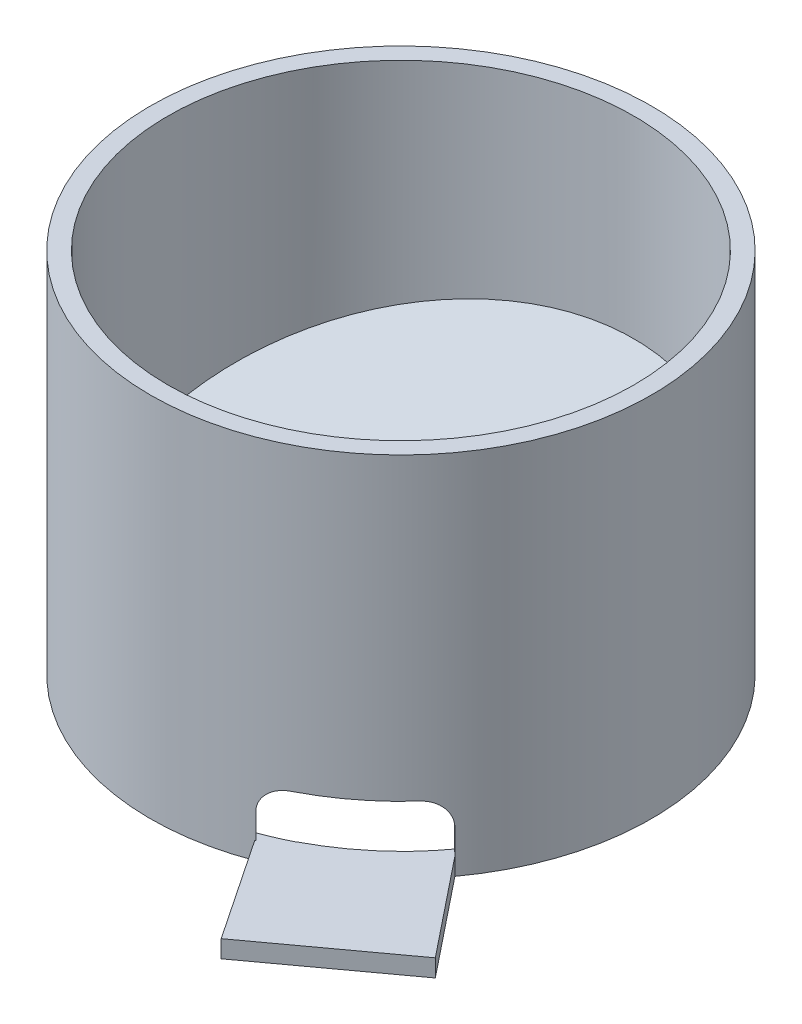
ISO-10303-21;
HEADER;
FILE_DESCRIPTION(('STEP AP214'),'2;1');
FILE_NAME('part.step','',(''),(''),'','','');
FILE_SCHEMA(('AUTOMOTIVE_DESIGN { 1 0 10303 214 1 1 1 1 }'));
ENDSEC;
DATA;
#1=APPLICATION_CONTEXT('core data for automotive mechanical design processes');
#2=APPLICATION_PROTOCOL_DEFINITION('international standard','automotive_design',2000,#1);
#3=PRODUCT_CONTEXT('',#1,'mechanical');
#4=PRODUCT('Part','Part','',(#3));
#5=PRODUCT_RELATED_PRODUCT_CATEGORY('part','',(#4));
#6=PRODUCT_DEFINITION_FORMATION('','',#4);
#7=PRODUCT_DEFINITION_CONTEXT('part definition',#1,'design');
#8=PRODUCT_DEFINITION('design','',#6,#7);
#9=PRODUCT_DEFINITION_SHAPE('','',#8);
#10=(LENGTH_UNIT() NAMED_UNIT(*) SI_UNIT(.MILLI.,.METRE.));
#11=(NAMED_UNIT(*) PLANE_ANGLE_UNIT() SI_UNIT($,.RADIAN.));
#12=(NAMED_UNIT(*) SI_UNIT($,.STERADIAN.) SOLID_ANGLE_UNIT());
#13=UNCERTAINTY_MEASURE_WITH_UNIT(LENGTH_MEASURE(1.E-05),#10,'distance_accuracy_value','');
#14=(GEOMETRIC_REPRESENTATION_CONTEXT(3) GLOBAL_UNCERTAINTY_ASSIGNED_CONTEXT((#13)) GLOBAL_UNIT_ASSIGNED_CONTEXT((#10,
#11,#12)) REPRESENTATION_CONTEXT('',''));
#15=CARTESIAN_POINT('',(0.,0.,0.));
#16=DIRECTION('',(0.,0.,1.));
#17=DIRECTION('',(1.,0.,0.));
#18=AXIS2_PLACEMENT_3D('',#15,#16,#17);
#19=CARTESIAN_POINT('',(14.9059247499879,0.,39.87722304956));
#20=DIRECTION('',(-0.590200374501547,0.,-0.807256785625388));
#21=DIRECTION('',(-0.807256785625388,0.,0.590200374501547));
#22=AXIS2_PLACEMENT_3D('',#19,#20,#21);
#23=PLANE('',#22);
#24=DIRECTION('',(0.,-1.,0.));
#25=VECTOR('',#24,1.);
#26=CARTESIAN_POINT('',(29.3445279209477,4.,29.3208930805553));
#27=LINE('',#26,#25);
#28=CARTESIAN_POINT('',(29.3445279209476,3.,29.3208930805553));
#29=VERTEX_POINT('',#28);
#30=CARTESIAN_POINT('',(29.3445279209476,0.,29.3208930805554));
#31=VERTEX_POINT('',#30);
#32=EDGE_CURVE('E11',#29,#31,#27,.T.);
#33=ORIENTED_EDGE('',*,*,#32,.F.);
#34=DIRECTION('',(-0.807256785625388,0.,0.590200374501547));
#35=VECTOR('',#34,1.);
#36=CARTESIAN_POINT('',(14.9059247499879,3.,39.87722304956));
#37=LINE('',#36,#35);
#38=CARTESIAN_POINT('',(29.4344119465568,3.,29.2551772061014));
#39=VERTEX_POINT('',#38);
#40=EDGE_CURVE('E182',#39,#29,#37,.T.);
#41=ORIENTED_EDGE('',*,*,#40,.F.);
#42=DIRECTION('',(0.,-1.,0.));
#43=VECTOR('',#42,1.);
#44=CARTESIAN_POINT('',(29.4344119465568,3.,29.2551772061014));
#45=LINE('',#44,#43);
#46=CARTESIAN_POINT('',(29.4344119465567,0.,29.2551772061015));
#47=VERTEX_POINT('',#46);
#48=EDGE_CURVE('E163',#47,#39,#45,.F.);
#49=ORIENTED_EDGE('',*,*,#48,.F.);
#50=DIRECTION('',(-0.807256785625388,0.,0.590200374501547));
#51=VECTOR('',#50,1.);
#52=CARTESIAN_POINT('',(14.9059247499879,0.,39.87722304956));
#53=LINE('',#52,#51);
#54=EDGE_CURVE('E158',#47,#31,#53,.T.);
#55=ORIENTED_EDGE('',*,*,#54,.T.);
#56=EDGE_LOOP('',(#33,#41,#49,#55));
#57=FACE_BOUND('',#56,.T.);
#58=ADVANCED_FACE('F32',(#57),#23,.T.);
#59=CARTESIAN_POINT('',(0.,63.,0.));
#60=DIRECTION('',(0.,-1.,0.));
#61=DIRECTION('',(0.,0.,-1.));
#62=AXIS2_PLACEMENT_3D('',#59,#60,#61);
#63=CYLINDRICAL_SURFACE('',#62,40.);
#64=DIRECTION('',(0.,-1.,0.));
#65=VECTOR('',#64,1.);
#66=CARTESIAN_POINT('',(12.8586087223702,63.,37.8768554888732));
#67=LINE('',#66,#65);
#68=CARTESIAN_POINT('',(12.8586087223702,7.25,37.8768554888732));
#69=VERTEX_POINT('',#68);
#70=CARTESIAN_POINT('',(12.8586087223702,3.,37.8768554888732));
#71=VERTEX_POINT('',#70);
#72=EDGE_CURVE('E225',#69,#71,#67,.T.);
#73=ORIENTED_EDGE('',*,*,#72,.T.);
#74=CARTESIAN_POINT('',(0.,3.,0.));
#75=DIRECTION('',(0.,-1.,0.));
#76=DIRECTION('',(0.,0.,-1.));
#77=AXIS2_PLACEMENT_3D('',#74,#75,#76);
#78=CIRCLE('',#77,40.);
#79=CARTESIAN_POINT('',(32.4982527265658,3.,23.3208826959928));
#80=VERTEX_POINT('',#79);
#81=EDGE_CURVE('E283',#71,#80,#78,.T.);
#82=ORIENTED_EDGE('',*,*,#81,.T.);
#83=DIRECTION('',(0.,-1.,0.));
#84=VECTOR('',#83,1.);
#85=CARTESIAN_POINT('',(32.4982527265658,63.,23.3208826959929));
#86=LINE('',#85,#84);
#87=CARTESIAN_POINT('',(32.4982527265658,7.25,23.3208826959928));
#88=VERTEX_POINT('',#87);
#89=EDGE_CURVE('E204',#80,#88,#86,.F.);
#90=ORIENTED_EDGE('',*,*,#89,.T.);
#91=CARTESIAN_POINT('',(32.4982527265658,7.25,23.3208826959928));
#92=CARTESIAN_POINT('',(32.4982577471647,7.36884260870351,23.3208688099019));
#93=CARTESIAN_POINT('',(32.4953171145322,7.48768257288682,23.3249733341994));
#94=CARTESIAN_POINT('',(32.4835811137329,7.72450154242642,23.3413184090219));
#95=CARTESIAN_POINT('',(32.4747862216721,7.84248061700704,23.3535582979268));
#96=CARTESIAN_POINT('',(32.4513916496947,8.07660775951056,23.3860547414548));
#97=CARTESIAN_POINT('',(32.4367986211488,8.19275776748268,23.4063021101219));
#98=CARTESIAN_POINT('',(32.4018788383984,8.42254026573257,23.4546187654033));
#99=CARTESIAN_POINT('',(32.3815521142613,8.53617276920867,23.4826880109999));
#100=CARTESIAN_POINT('',(32.3352575672257,8.7601357282766,23.5463938921091));
#101=CARTESIAN_POINT('',(32.309289000433,8.87046574624086,23.5820315255228));
#102=CARTESIAN_POINT('',(32.2518264290729,9.08707587589191,23.6605591580926));
#103=CARTESIAN_POINT('',(32.2203303837283,9.19335447406905,23.7034518356405));
#104=CARTESIAN_POINT('',(32.1519786208148,9.40104611337569,23.7960832507992));
#105=CARTESIAN_POINT('',(32.1151251548937,9.5024611748838,23.8458191118493));
#106=CARTESIAN_POINT('',(32.0362293740246,9.69978679836063,23.9517091936018));
#107=CARTESIAN_POINT('',(31.9941851386052,9.79569530368114,24.0078657892645));
#108=CARTESIAN_POINT('',(31.8600485007693,10.0751800826647,24.1859347306249));
#109=CARTESIAN_POINT('',(31.7602894437638,10.249486828137,24.316985061015));
#110=CARTESIAN_POINT('',(31.5425743837892,10.5681864643716,24.5987325686261));
#111=CARTESIAN_POINT('',(31.424614522327,10.7125729969334,24.7494339107263));
#112=CARTESIAN_POINT('',(31.1721627195108,10.9683464919181,25.0666626846308));
#113=CARTESIAN_POINT('',(31.0375684953067,11.0795133028842,25.2332864414905));
#114=CARTESIAN_POINT('',(30.7556191562859,11.2642958314108,25.5761807882963));
#115=CARTESIAN_POINT('',(30.6082719990185,11.3379347707236,25.7524453376837));
#116=CARTESIAN_POINT('',(30.3550540482441,11.4276844268834,26.049860271274));
#117=CARTESIAN_POINT('',(30.2516366260293,11.4547750196318,26.1698993862704));
#118=CARTESIAN_POINT('',(30.0421594374652,11.49093367365,26.4101173085203));
#119=CARTESIAN_POINT('',(29.9361031242194,11.5000241500839,26.5302957553266));
#120=CARTESIAN_POINT('',(29.8292553554512,11.5,26.6498691355002));
#121=B_SPLINE_CURVE_WITH_KNOTS('',3,(#91,#92,#93,#94,#95,#96,#97,#98,#99,#100,#101,#102,#103,
#104,#105,#106,#107,#108,#109,#110,#111,#112,#113,#114,#115,#116,#117,#118,#119,#120),
.UNSPECIFIED.,.F.,.F.,(4,2,2,2,2,2,2,2,2,2,2,2,2,2,4),(0.,0.35641672770918,0.712804472865604,
1.06878456042684,1.42476278127904,1.78078796746734,2.13694487781616,2.49295253093555,
2.84909229607266,3.56485836030117,4.28077637290381,5.00133869533878,5.72145460026396,
6.20271795961621,6.6833816340378),.UNSPECIFIED.);
#122=CARTESIAN_POINT('',(29.8292553554512,11.5,26.6498691355002));
#123=VERTEX_POINT('',#122);
#124=EDGE_CURVE('E194',#88,#123,#121,.T.);
#125=ORIENTED_EDGE('',*,*,#124,.T.);
#126=CARTESIAN_POINT('',(0.,11.5,0.));
#127=DIRECTION('',(0.,1.,0.));
#128=DIRECTION('',(0.,0.,1.));
#129=AXIS2_PLACEMENT_3D('',#126,#127,#128);
#130=CIRCLE('',#129,40.);
#131=CARTESIAN_POINT('',(17.172839901921,11.5,36.1260788033103));
#132=VERTEX_POINT('',#131);
#133=EDGE_CURVE('E226',#123,#132,#130,.F.);
#134=ORIENTED_EDGE('',*,*,#133,.T.);
#135=CARTESIAN_POINT('',(17.172839901921,11.5,36.1260788033104));
#136=CARTESIAN_POINT('',(17.0483724960303,11.4999968971606,36.1852501738238));
#137=CARTESIAN_POINT('',(16.9236577774394,11.494137630218,36.2437401882979));
#138=CARTESIAN_POINT('',(16.6745387359936,11.4708718112855,36.3590227829476));
#139=CARTESIAN_POINT('',(16.5501343764667,11.4534666954045,36.4158155733113));
#140=CARTESIAN_POINT('',(16.1786976635341,11.3842058810773,36.5831003541278));
#141=CARTESIAN_POINT('',(15.9332887806434,11.3153043052489,36.6905713228706));
#142=CARTESIAN_POINT('',(15.4543457982531,11.133946707841,36.8948647059835));
#143=CARTESIAN_POINT('',(15.2208131550314,11.0214853594118,36.9916858161407));
#144=CARTESIAN_POINT('',(14.8851620498599,10.8221311911214,37.1274381202419));
#145=CARTESIAN_POINT('',(14.7756661093771,10.7505238556028,37.1711294072781));
#146=CARTESIAN_POINT('',(14.5624862851076,10.5974100860349,37.2551617411653));
#147=CARTESIAN_POINT('',(14.458799973016,10.515907833654,37.2955041912079));
#148=CARTESIAN_POINT('',(14.2593978680722,10.344404065874,37.3721937375141));
#149=CARTESIAN_POINT('',(14.163603628389,10.254511998442,37.4085817188786));
#150=CARTESIAN_POINT('',(13.9797156944909,10.0659528401719,37.477689235785));
#151=CARTESIAN_POINT('',(13.8916181869812,9.96729014413051,37.51041059023));
#152=CARTESIAN_POINT('',(13.7241092784845,9.76170106455275,37.5720214203036));
#153=CARTESIAN_POINT('',(13.644699081551,9.65477353901418,37.6009103648814));
#154=CARTESIAN_POINT('',(13.4956514249381,9.43336396192428,37.6546633448806));
#155=CARTESIAN_POINT('',(13.426012603248,9.31888296651168,37.6795279413215));
#156=CARTESIAN_POINT('',(13.3029094054325,9.09303839029065,37.723156095744));
#157=CARTESIAN_POINT('',(13.2485806163436,8.98221054040497,37.7422554650956));
#158=CARTESIAN_POINT('',(13.1497806526658,8.75570327395567,37.7767919489013));
#159=CARTESIAN_POINT('',(13.1053079208895,8.64002462722304,37.7922296419014));
#160=CARTESIAN_POINT('',(13.0269758194965,8.40494200800249,37.819302193559));
#161=CARTESIAN_POINT('',(12.9930962462077,8.28554561056957,37.8309442931501));
#162=CARTESIAN_POINT('',(12.9364136678875,8.04390220044637,37.8503645989604));
#163=CARTESIAN_POINT('',(12.9136039984202,7.92165694943519,37.8581451300315));
#164=CARTESIAN_POINT('',(12.8839162306674,7.7076995338805,37.8682569362919));
#165=CARTESIAN_POINT('',(12.8744293843573,7.61638267353988,37.8714819757316));
#166=CARTESIAN_POINT('',(12.8617751819368,7.43338148418634,37.8757805134898));
#167=CARTESIAN_POINT('',(12.8585996369725,7.34169778620419,37.8768567998032));
#168=CARTESIAN_POINT('',(12.8586087223702,7.25,37.8768554888732));
#169=B_SPLINE_CURVE_WITH_KNOTS('',3,(#135,#136,#137,#138,#139,#140,#141,#142,#143,#144,#145,
#146,#147,#148,#149,#150,#151,#152,#153,#154,#155,#156,#157,#158,#159,#160,#161,#162,#163,#164,
#165,#166,#167,#168),.UNSPECIFIED.,.F.,.F.,(4,2,2,2,2,2,2,2,2,2,2,2,2,2,2,2,4),(0.,
0.413191244283983,0.826331104180502,1.65210961653774,2.47798914383197,2.8913625013443,
3.30456176823157,3.71297231550807,4.12117935724059,4.52944290462306,4.93764948839284,
5.31182585468265,5.68594306153905,6.05934232301087,6.43251650646414,6.70787933064908,
6.98288464031937),.UNSPECIFIED.);
#170=EDGE_CURVE('E215',#132,#69,#169,.T.);
#171=ORIENTED_EDGE('',*,*,#170,.T.);
#172=EDGE_LOOP('',(#73,#82,#90,#125,#134,#171));
#173=FACE_BOUND('',#172,.T.);
#174=CARTESIAN_POINT('',(0.,63.,0.));
#175=DIRECTION('',(0.,1.,0.));
#176=DIRECTION('',(0.,0.,1.));
#177=AXIS2_PLACEMENT_3D('',#174,#175,#176);
#178=CIRCLE('',#177,40.);
#179=CARTESIAN_POINT('',(0.,63.,40.));
#180=VERTEX_POINT('',#179);
#181=EDGE_CURVE('E279',#180,#180,#178,.T.);
#182=ORIENTED_EDGE('',*,*,#181,.T.);
#183=EDGE_LOOP('',(#182));
#184=FACE_BOUND('',#183,.T.);
#185=CARTESIAN_POINT('',(0.,13.,0.));
#186=DIRECTION('',(0.,1.,0.));
#187=DIRECTION('',(0.,0.,1.));
#188=AXIS2_PLACEMENT_3D('',#185,#186,#187);
#189=CIRCLE('',#188,40.);
#190=CARTESIAN_POINT('',(37.0809924354783,13.,15.));
#191=VERTEX_POINT('',#190);
#192=CARTESIAN_POINT('',(32.7261363439071,13.,23.));
#193=VERTEX_POINT('',#192);
#194=EDGE_CURVE('E322',#191,#193,#189,.F.);
#195=ORIENTED_EDGE('',*,*,#194,.F.);
#196=CARTESIAN_POINT('',(0.,17.0192378864669,0.));
#197=DIRECTION('',(0.,0.965925826289068,0.258819045102522));
#198=DIRECTION('',(0.,-0.258819045102522,0.965925826289068));
#199=AXIS2_PLACEMENT_3D('',#196,#197,#198);
#200=ELLIPSE('',#199,41.4110472164033,40.);
#201=CARTESIAN_POINT('',(-37.0809924354783,13.,15.));
#202=VERTEX_POINT('',#201);
#203=EDGE_CURVE('E330',#202,#191,#200,.F.);
#204=ORIENTED_EDGE('',*,*,#203,.F.);
#205=CARTESIAN_POINT('',(0.,13.,0.));
#206=DIRECTION('',(0.,-1.,0.));
#207=DIRECTION('',(0.,0.,-1.));
#208=AXIS2_PLACEMENT_3D('',#205,#206,#207);
#209=CIRCLE('',#208,40.);
#210=CARTESIAN_POINT('',(-32.7261363439071,13.,23.));
#211=VERTEX_POINT('',#210);
#212=EDGE_CURVE('E318',#202,#211,#209,.F.);
#213=ORIENTED_EDGE('',*,*,#212,.T.);
#214=CARTESIAN_POINT('',(0.,19.1628314259158,0.));
#215=DIRECTION('',(0.,-0.965925826289068,-0.258819045102522));
#216=DIRECTION('',(0.,-0.258819045102522,0.965925826289068));
#217=AXIS2_PLACEMENT_3D('',#214,#215,#216);
#218=ELLIPSE('',#217,41.4110472164033,40.);
#219=EDGE_CURVE('E332',#193,#211,#218,.F.);
#220=ORIENTED_EDGE('',*,*,#219,.F.);
#221=EDGE_LOOP('',(#195,#204,#213,#220));
#222=FACE_BOUND('',#221,.T.);
#223=ADVANCED_FACE('F344',(#173,#184,#222),#63,.F.);
#224=CARTESIAN_POINT('',(0.,63.,0.));
#225=DIRECTION('',(0.,1.,0.));
#226=DIRECTION('',(0.,0.,1.));
#227=AXIS2_PLACEMENT_3D('',#224,#225,#226);
#228=PLANE('',#227);
#229=CARTESIAN_POINT('',(0.,63.,0.));
#230=DIRECTION('',(0.,1.,0.));
#231=DIRECTION('',(0.,0.,1.));
#232=AXIS2_PLACEMENT_3D('',#229,#230,#231);
#233=CIRCLE('',#232,43.);
#234=CARTESIAN_POINT('',(0.,63.,43.));
#235=VERTEX_POINT('',#234);
#236=EDGE_CURVE('E248',#235,#235,#233,.T.);
#237=ORIENTED_EDGE('',*,*,#236,.T.);
#238=EDGE_LOOP('',(#237));
#239=FACE_BOUND('',#238,.T.);
#240=ORIENTED_EDGE('',*,*,#181,.F.);
#241=EDGE_LOOP('',(#240));
#242=FACE_BOUND('',#241,.T.);
#243=ADVANCED_FACE('F377',(#239,#242),#228,.T.);
#244=CARTESIAN_POINT('',(0.,0.,0.));
#245=DIRECTION('',(0.,1.,0.));
#246=DIRECTION('',(0.,0.,1.));
#247=AXIS2_PLACEMENT_3D('',#244,#245,#246);
#248=PLANE('',#247);
#249=DIRECTION('',(0.556989891277437,0.,0.830519271910501));
#250=VECTOR('',#249,1.);
#251=CARTESIAN_POINT('',(26.8812074124527,0.,57.7333873956358));
#252=LINE('',#251,#250);
#253=CARTESIAN_POINT('',(15.1508418831987,0.,40.2424153130787));
#254=VERTEX_POINT('',#253);
#255=CARTESIAN_POINT('',(26.8812074124527,0.,57.7333873956358));
#256=VERTEX_POINT('',#255);
#257=EDGE_CURVE('E184',#254,#256,#252,.T.);
#258=ORIENTED_EDGE('',*,*,#257,.F.);
#259=CARTESIAN_POINT('',(0.,0.,0.));
#260=DIRECTION('',(0.,1.,0.));
#261=DIRECTION('',(0.,0.,1.));
#262=AXIS2_PLACEMENT_3D('',#259,#260,#261);
#263=CIRCLE('',#262,43.);
#264=CARTESIAN_POINT('',(34.6837159978099,0.,25.4173138742721));
#265=VERTEX_POINT('',#264);
#266=EDGE_CURVE('E249',#265,#254,#263,.T.);
#267=ORIENTED_EDGE('',*,*,#266,.F.);
#268=DIRECTION('',(-0.624590996751247,0.,-0.780952038717669));
#269=VECTOR('',#268,1.);
#270=CARTESIAN_POINT('',(34.6837159978099,0.,25.4173138742721));
#271=LINE('',#270,#269);
#272=CARTESIAN_POINT('',(48.1124224279617,0.,42.207782706702));
#273=VERTEX_POINT('',#272);
#274=EDGE_CURVE('E169',#273,#265,#271,.T.);
#275=ORIENTED_EDGE('',*,*,#274,.F.);
#276=DIRECTION('',(0.807201162504432,0.,-0.590276446465124));
#277=VECTOR('',#276,1.);
#278=CARTESIAN_POINT('',(48.1124224279617,0.,42.207782706702));
#279=LINE('',#278,#277);
#280=EDGE_CURVE('E302',#256,#273,#279,.T.);
#281=ORIENTED_EDGE('',*,*,#280,.F.);
#282=EDGE_LOOP('',(#258,#267,#275,#281));
#283=FACE_BOUND('',#282,.T.);
#284=CARTESIAN_POINT('',(19.1187805303791,0.,36.7971262283464));
#285=VERTEX_POINT('',#284);
#286=CARTESIAN_POINT('',(18.948610907269,0.,36.9215403888425));
#287=VERTEX_POINT('',#286);
#288=EDGE_CURVE('E159',#285,#287,#53,.T.);
#289=ORIENTED_EDGE('',*,*,#288,.F.);
#290=CARTESIAN_POINT('',(-0.870151283346818,0.,-1.2744196418467));
#291=DIRECTION('',(0.,-1.,0.));
#292=DIRECTION('',(0.,0.,-1.));
#293=AXIS2_PLACEMENT_3D('',#290,#291,#292);
#294=CIRCLE('',#293,43.);
#295=EDGE_CURVE('E47',#31,#285,#294,.T.);
#296=ORIENTED_EDGE('',*,*,#295,.F.);
#297=ORIENTED_EDGE('',*,*,#54,.F.);
#298=CARTESIAN_POINT('',(0.,0.,0.));
#299=DIRECTION('',(0.,-1.,0.));
#300=DIRECTION('',(0.,0.,-1.));
#301=AXIS2_PLACEMENT_3D('',#298,#299,#300);
#302=CIRCLE('',#301,41.5);
#303=EDGE_CURVE('E280',#287,#47,#302,.T.);
#304=ORIENTED_EDGE('',*,*,#303,.F.);
#305=EDGE_LOOP('',(#289,#296,#297,#304));
#306=FACE_BOUND('',#305,.T.);
#307=ADVANCED_FACE('F156',(#283,#306),#248,.F.);
#308=CARTESIAN_POINT('',(0.,63.,0.));
#309=DIRECTION('',(0.,-1.,0.));
#310=DIRECTION('',(0.,0.,-1.));
#311=AXIS2_PLACEMENT_3D('',#308,#309,#310);
#312=CYLINDRICAL_SURFACE('',#311,43.);
#313=ORIENTED_EDGE('',*,*,#236,.F.);
#314=EDGE_LOOP('',(#313));
#315=FACE_BOUND('',#314,.T.);
#316=DIRECTION('',(0.,-1.,0.));
#317=VECTOR('',#316,1.);
#318=CARTESIAN_POINT('',(34.6837159978099,63.,25.4173138742722));
#319=LINE('',#318,#317);
#320=CARTESIAN_POINT('',(34.6837159978099,7.25,25.4173138742721));
#321=VERTEX_POINT('',#320);
#322=CARTESIAN_POINT('',(34.6837159978099,3.,25.4173138742722));
#323=VERTEX_POINT('',#322);
#324=EDGE_CURVE('E319',#321,#323,#319,.T.);
#325=ORIENTED_EDGE('',*,*,#324,.T.);
#326=DIRECTION('',(0.,1.,0.));
#327=VECTOR('',#326,1.);
#328=CARTESIAN_POINT('',(34.6837159978099,0.,25.4173138742721));
#329=LINE('',#328,#327);
#330=EDGE_CURVE('E55',#265,#323,#329,.T.);
#331=ORIENTED_EDGE('',*,*,#330,.F.);
#332=ORIENTED_EDGE('',*,*,#266,.T.);
#333=DIRECTION('',(0.,-1.,0.));
#334=VECTOR('',#333,1.);
#335=CARTESIAN_POINT('',(15.1508418831987,63.,40.2424153130787));
#336=LINE('',#335,#334);
#337=CARTESIAN_POINT('',(15.1508418831987,3.,40.2424153130787));
#338=VERTEX_POINT('',#337);
#339=EDGE_CURVE('E260',#254,#338,#336,.F.);
#340=ORIENTED_EDGE('',*,*,#339,.T.);
#341=CARTESIAN_POINT('',(0.,3.,0.));
#342=DIRECTION('',(0.,-1.,0.));
#343=DIRECTION('',(0.,0.,-1.));
#344=AXIS2_PLACEMENT_3D('',#341,#342,#343);
#345=CIRCLE('',#344,43.);
#346=CARTESIAN_POINT('',(15.2754816837677,3.,40.1952691162639));
#347=VERTEX_POINT('',#346);
#348=EDGE_CURVE('E186',#347,#338,#345,.T.);
#349=ORIENTED_EDGE('',*,*,#348,.F.);
#350=DIRECTION('',(0.,-1.,0.));
#351=VECTOR('',#350,1.);
#352=CARTESIAN_POINT('',(15.2754816837677,63.,40.1952691162639));
#353=LINE('',#352,#351);
#354=CARTESIAN_POINT('',(15.2754816837677,7.25,40.1952691162639));
#355=VERTEX_POINT('',#354);
#356=EDGE_CURVE('E313',#347,#355,#353,.F.);
#357=ORIENTED_EDGE('',*,*,#356,.T.);
#358=CARTESIAN_POINT('',(15.2754816837677,7.25,40.1952691162639));
#359=CARTESIAN_POINT('',(15.2754601615943,7.36182403358158,40.1952735794893));
#360=CARTESIAN_POINT('',(15.2800471202531,7.47364068131338,40.1935340017495));
#361=CARTESIAN_POINT('',(15.298278613562,7.69639355090382,40.1866003309655));
#362=CARTESIAN_POINT('',(15.3119205024529,7.80733002036291,40.1814072470002));
#363=CARTESIAN_POINT('',(15.3480369340045,8.02712329413486,40.1676251688649));
#364=CARTESIAN_POINT('',(15.3704792159998,8.13598618845442,40.1590485773415));
#365=CARTESIAN_POINT('',(15.4239030240367,8.35127433700321,40.138560493331));
#366=CARTESIAN_POINT('',(15.4548848673956,8.45769950049083,40.1266488769191));
#367=CARTESIAN_POINT('',(15.5249828982644,8.66730038823718,40.099579958979));
#368=CARTESIAN_POINT('',(15.5640913943681,8.77047907953661,40.0844257259993));
#369=CARTESIAN_POINT('',(15.6500090525371,8.9730630058668,40.0509593001619));
#370=CARTESIAN_POINT('',(15.6968210922631,9.07246681364576,40.0326459270828));
#371=CARTESIAN_POINT('',(15.8481141553845,9.36416859644808,39.9731039111452));
#372=CARTESIAN_POINT('',(15.9634762250788,9.55002794692138,39.9272641803607));
#373=CARTESIAN_POINT('',(16.224410837745,9.90824333733479,39.821967532813));
#374=CARTESIAN_POINT('',(16.3711061245687,10.0796201099616,39.7619921610912));
#375=CARTESIAN_POINT('',(16.6862304850547,10.3960844185046,39.6307814164365));
#376=CARTESIAN_POINT('',(16.8546672871826,10.5411625617306,39.5595420374467));
#377=CARTESIAN_POINT('',(17.22408881132,10.8142393494872,39.4001860633429));
#378=CARTESIAN_POINT('',(17.4266354330294,10.9395798782679,39.3111327769255));
#379=CARTESIAN_POINT('',(17.8456531501702,11.1538935973915,39.1226970298031));
#380=CARTESIAN_POINT('',(18.0621255696019,11.2428633238355,39.0233135863998));
#381=CARTESIAN_POINT('',(18.4780508326237,11.374588988576,38.8279310006931));
#382=CARTESIAN_POINT('',(18.6766274428748,11.4214596030398,38.7328395361771));
#383=CARTESIAN_POINT('',(18.9761048250516,11.4684861263016,38.5865240946728));
#384=CARTESIAN_POINT('',(19.0761906602799,11.4802817205222,38.5371436583827));
#385=CARTESIAN_POINT('',(19.2764818396351,11.4960385418817,38.4373489487287));
#386=CARTESIAN_POINT('',(19.3766871994768,11.4999985900635,38.3869345209405));
#387=CARTESIAN_POINT('',(19.4767253983942,11.5,38.3361078848068));
#388=B_SPLINE_CURVE_WITH_KNOTS('',3,(#358,#359,#360,#361,#362,#363,#364,#365,#366,#367,#368,
#369,#370,#371,#372,#373,#374,#375,#376,#377,#378,#379,#380,#381,#382,#383,#384,#385,#386,#387),
.UNSPECIFIED.,.F.,.F.,(4,2,2,2,2,2,2,2,2,2,2,2,2,2,4),(0.,0.33535301457607,0.670608085495547,
1.00464549081466,1.3386953101372,1.67243039900329,2.00629043886555,2.67378652117631,
3.37121501495181,4.06889211020829,4.82848142068816,5.58814305643694,6.26112838713221,
6.59756301330529,6.93404825648506),.UNSPECIFIED.);
#389=CARTESIAN_POINT('',(19.4767253983942,11.5,38.3361078848068));
#390=VERTEX_POINT('',#389);
#391=EDGE_CURVE('E239',#355,#390,#388,.T.);
#392=ORIENTED_EDGE('',*,*,#391,.T.);
#393=CARTESIAN_POINT('',(0.,11.5,0.));
#394=DIRECTION('',(0.,1.,0.));
#395=DIRECTION('',(0.,0.,1.));
#396=AXIS2_PLACEMENT_3D('',#393,#394,#395);
#397=CIRCLE('',#396,43.);
#398=CARTESIAN_POINT('',(31.9954813110646,11.5,28.7278466939886));
#399=VERTEX_POINT('',#398);
#400=EDGE_CURVE('E247',#390,#399,#397,.T.);
#401=ORIENTED_EDGE('',*,*,#400,.T.);
#402=CARTESIAN_POINT('',(31.9954813110646,11.5,28.7278466939887));
#403=CARTESIAN_POINT('',(32.0753807801895,11.5000130877894,28.6388666073298));
#404=CARTESIAN_POINT('',(32.1548996860482,11.4949584943058,28.5495488780793));
#405=CARTESIAN_POINT('',(32.3126295622515,11.4748176064776,28.3709015122506));
#406=CARTESIAN_POINT('',(32.3908406344619,11.4597320971976,28.2815718771512));
#407=CARTESIAN_POINT('',(32.5453443973625,11.419652804915,28.1036378295657));
#408=CARTESIAN_POINT('',(32.6216389058997,11.394668819428,28.0150327881218));
#409=CARTESIAN_POINT('',(32.7718880393854,11.3349849855163,27.8391222377726));
#410=CARTESIAN_POINT('',(32.8458426749848,11.3002851813243,27.7518167229531));
#411=CARTESIAN_POINT('',(32.9909535092747,11.221417545269,27.5791535215084));
#412=CARTESIAN_POINT('',(33.0621092865104,11.1772482938972,27.4937961290397));
#413=CARTESIAN_POINT('',(33.2011998599522,11.0797489636127,27.3256699479317));
#414=CARTESIAN_POINT('',(33.269133455311,11.0264155030725,27.2429021282291));
#415=CARTESIAN_POINT('',(33.4013251847704,10.9109970181689,27.0806649953637));
#416=CARTESIAN_POINT('',(33.4655849567823,10.848915937235,27.001194216676));
#417=CARTESIAN_POINT('',(33.5901026775593,10.7164285976503,26.8461339983862));
#418=CARTESIAN_POINT('',(33.6503591379213,10.6460192693676,26.7705460047193));
#419=CARTESIAN_POINT('',(33.8250163061486,10.42246252269,26.5500173896766));
#420=CARTESIAN_POINT('',(33.9329200756982,10.2573236113318,26.4117864905671));
#421=CARTESIAN_POINT('',(34.1288286353251,9.90003125410169,26.1581513300754));
#422=CARTESIAN_POINT('',(34.2168297858667,9.70787287765883,26.0427512441818));
#423=CARTESIAN_POINT('',(34.3712356431607,9.30174811105494,25.8386257686677));
#424=CARTESIAN_POINT('',(34.4376277076486,9.08776905062226,25.7499159963386));
#425=CARTESIAN_POINT('',(34.547354522377,8.64420829172892,25.6025155588658));
#426=CARTESIAN_POINT('',(34.5907045578783,8.4146370508585,25.5438049943194));
#427=CARTESIAN_POINT('',(34.642609823297,8.02800942079696,25.4733345339052));
#428=CARTESIAN_POINT('',(34.6580205739713,7.87345978646473,25.4523501159968));
#429=CARTESIAN_POINT('',(34.6785697904968,7.56262969494424,25.4243364623236));
#430=CARTESIAN_POINT('',(34.683721603246,7.40635175296934,25.4172890945119));
#431=CARTESIAN_POINT('',(34.6837159978099,7.25,25.4173138742721));
#432=B_SPLINE_CURVE_WITH_KNOTS('',3,(#402,#403,#404,#405,#406,#407,#408,#409,#410,#411,#412,
#413,#414,#415,#416,#417,#418,#419,#420,#421,#422,#423,#424,#425,#426,#427,#428,#429,#430,#431),
.UNSPECIFIED.,.F.,.F.,(4,2,2,2,2,2,2,2,2,2,2,2,2,2,4),(0.,0.358652935701364,0.717277804916335,
1.07554859036755,1.433817744766,1.79214064276801,2.15059604833174,2.50889037603712,
2.86731717809104,3.58623768682175,4.30528955640509,5.02476134989528,5.7437552739019,
6.21303514995433,6.68170409205605),.UNSPECIFIED.);
#433=EDGE_CURVE('E253',#399,#321,#432,.T.);
#434=ORIENTED_EDGE('',*,*,#433,.T.);
#435=EDGE_LOOP('',(#325,#331,#332,#340,#349,#357,#392,#401,#434));
#436=FACE_BOUND('',#435,.T.);
#437=ADVANCED_FACE('F34',(#315,#436),#312,.T.);
#438=CARTESIAN_POINT('',(0.,3.,0.));
#439=DIRECTION('',(0.,-1.,0.));
#440=DIRECTION('',(0.,0.,-1.));
#441=AXIS2_PLACEMENT_3D('',#438,#439,#440);
#442=CYLINDRICAL_SURFACE('',#441,41.5);
#443=CARTESIAN_POINT('',(0.,3.,0.));
#444=DIRECTION('',(0.,-1.,0.));
#445=DIRECTION('',(0.,0.,-1.));
#446=AXIS2_PLACEMENT_3D('',#443,#444,#445);
#447=CIRCLE('',#446,41.5);
#448=CARTESIAN_POINT('',(14.0724227321812,3.,39.0412207602015));
#449=VERTEX_POINT('',#448);
#450=CARTESIAN_POINT('',(33.5913601747821,3.,24.3694587877545));
#451=VERTEX_POINT('',#450);
#452=EDGE_CURVE('E275',#449,#451,#447,.T.);
#453=ORIENTED_EDGE('',*,*,#452,.F.);
#454=CARTESIAN_POINT('',(18.9486109072689,3.,36.9215403888425));
#455=VERTEX_POINT('',#454);
#456=EDGE_CURVE('E271',#455,#449,#447,.T.);
#457=ORIENTED_EDGE('',*,*,#456,.F.);
#458=DIRECTION('',(0.,-1.,0.));
#459=VECTOR('',#458,1.);
#460=CARTESIAN_POINT('',(18.9486109072689,3.,36.9215403888425));
#461=LINE('',#460,#459);
#462=EDGE_CURVE('E190',#455,#287,#461,.T.);
#463=ORIENTED_EDGE('',*,*,#462,.T.);
#464=ORIENTED_EDGE('',*,*,#303,.T.);
#465=ORIENTED_EDGE('',*,*,#48,.T.);
#466=EDGE_CURVE('E277',#451,#39,#447,.T.);
#467=ORIENTED_EDGE('',*,*,#466,.F.);
#468=EDGE_LOOP('',(#453,#457,#463,#464,#465,#467));
#469=FACE_BOUND('',#468,.T.);
#470=ADVANCED_FACE('F272',(#469),#442,.F.);
#471=CARTESIAN_POINT('',(0.,3.,0.));
#472=DIRECTION('',(0.,-1.,0.));
#473=DIRECTION('',(0.,0.,-1.));
#474=AXIS2_PLACEMENT_3D('',#471,#472,#473);
#475=PLANE('',#474);
#476=DIRECTION('',(0.721653450006529,0.,0.69225450384499));
#477=VECTOR('',#476,1.);
#478=CARTESIAN_POINT('',(-56.6361415537378,3.,-28.7867957024061));
#479=LINE('',#478,#477);
#480=EDGE_CURVE('E349',#71,#449,#479,.T.);
#481=ORIENTED_EDGE('',*,*,#480,.T.);
#482=ORIENTED_EDGE('',*,*,#452,.T.);
#483=DIRECTION('',(0.721653450006529,0.,0.69225450384499));
#484=VECTOR('',#483,1.);
#485=CARTESIAN_POINT('',(-39.9528080110735,3.,-46.1786438475634));
#486=LINE('',#485,#484);
#487=EDGE_CURVE('E351',#80,#451,#486,.T.);
#488=ORIENTED_EDGE('',*,*,#487,.F.);
#489=ORIENTED_EDGE('',*,*,#81,.F.);
#490=EDGE_LOOP('',(#481,#482,#488,#489));
#491=FACE_BOUND('',#490,.T.);
#492=ADVANCED_FACE('F348',(#491),#475,.T.);
#493=CARTESIAN_POINT('',(43.002,13.,23.));
#494=DIRECTION('',(0.,1.,0.));
#495=DIRECTION('',(0.,0.,1.));
#496=AXIS2_PLACEMENT_3D('',#493,#494,#495);
#497=PLANE('',#496);
#498=DIRECTION('',(-1.,0.,0.));
#499=VECTOR('',#498,1.);
#500=CARTESIAN_POINT('',(43.002,13.,15.));
#501=LINE('',#500,#499);
#502=EDGE_CURVE('E334',#191,#202,#501,.T.);
#503=ORIENTED_EDGE('',*,*,#502,.F.);
#504=ORIENTED_EDGE('',*,*,#194,.T.);
#505=DIRECTION('',(-1.,0.,0.));
#506=VECTOR('',#505,1.);
#507=CARTESIAN_POINT('',(43.002,13.,23.));
#508=LINE('',#507,#506);
#509=EDGE_CURVE('E335',#193,#211,#508,.T.);
#510=ORIENTED_EDGE('',*,*,#509,.T.);
#511=ORIENTED_EDGE('',*,*,#212,.F.);
#512=EDGE_LOOP('',(#503,#504,#510,#511));
#513=FACE_BOUND('',#512,.T.);
#514=ADVANCED_FACE('F487',(#513),#497,.F.);
#515=CARTESIAN_POINT('',(43.002,13.,15.));
#516=DIRECTION('',(0.,0.965925826289068,0.258819045102522));
#517=DIRECTION('',(0.,-0.258819045102522,0.965925826289068));
#518=AXIS2_PLACEMENT_3D('',#515,#516,#517);
#519=PLANE('',#518);
#520=ORIENTED_EDGE('',*,*,#502,.T.);
#521=ORIENTED_EDGE('',*,*,#203,.T.);
#522=EDGE_LOOP('',(#520,#521));
#523=FACE_BOUND('',#522,.T.);
#524=ADVANCED_FACE('F495',(#523),#519,.F.);
#525=CARTESIAN_POINT('',(43.002,13.,23.));
#526=DIRECTION('',(0.,-0.965925826289068,-0.258819045102522));
#527=DIRECTION('',(0.,0.258819045102522,-0.965925826289068));
#528=AXIS2_PLACEMENT_3D('',#525,#526,#527);
#529=PLANE('',#528);
#530=ORIENTED_EDGE('',*,*,#509,.F.);
#531=ORIENTED_EDGE('',*,*,#219,.T.);
#532=EDGE_LOOP('',(#530,#531));
#533=FACE_BOUND('',#532,.T.);
#534=ADVANCED_FACE('F486',(#533),#529,.F.);
#535=CARTESIAN_POINT('',(-42.8948896524147,7.25,-43.1116166850357));
#536=DIRECTION('',(0.721653450006529,0.,0.69225450384499));
#537=DIRECTION('',(0.69225450384499,0.,-0.72165345000653));
#538=AXIS2_PLACEMENT_3D('',#535,#536,#537);
#539=CYLINDRICAL_SURFACE('',#538,4.25);
#540=DIRECTION('',(0.721653450006529,0.,0.69225450384499));
#541=VECTOR('',#540,1.);
#542=CARTESIAN_POINT('',(-42.8948896524147,11.5,-43.1116166850357));
#543=LINE('',#542,#541);
#544=EDGE_CURVE('E203',#123,#399,#543,.T.);
#545=ORIENTED_EDGE('',*,*,#544,.F.);
#546=ORIENTED_EDGE('',*,*,#124,.F.);
#547=DIRECTION('',(0.721653450006529,0.,0.69225450384499));
#548=VECTOR('',#547,1.);
#549=CARTESIAN_POINT('',(-39.9528080110735,7.25,-46.1786438475634));
#550=LINE('',#549,#548);
#551=EDGE_CURVE('E324',#88,#321,#550,.T.);
#552=ORIENTED_EDGE('',*,*,#551,.T.);
#553=ORIENTED_EDGE('',*,*,#433,.F.);
#554=EDGE_LOOP('',(#545,#546,#552,#553));
#555=FACE_BOUND('',#554,.T.);
#556=ADVANCED_FACE('F206',(#555),#539,.F.);
#557=CARTESIAN_POINT('',(-53.6940599123965,11.5,-31.8538228649338));
#558=DIRECTION('',(0.,1.,0.));
#559=DIRECTION('',(0.,0.,1.));
#560=AXIS2_PLACEMENT_3D('',#557,#558,#559);
#561=PLANE('',#560);
#562=DIRECTION('',(0.721653450006529,0.,0.69225450384499));
#563=VECTOR('',#562,1.);
#564=CARTESIAN_POINT('',(-53.6940599123965,11.5,-31.8538228649338));
#565=LINE('',#564,#563);
#566=EDGE_CURVE('E224',#132,#390,#565,.T.);
#567=ORIENTED_EDGE('',*,*,#566,.F.);
#568=ORIENTED_EDGE('',*,*,#133,.F.);
#569=ORIENTED_EDGE('',*,*,#544,.T.);
#570=ORIENTED_EDGE('',*,*,#400,.F.);
#571=EDGE_LOOP('',(#567,#568,#569,#570));
#572=FACE_BOUND('',#571,.T.);
#573=ADVANCED_FACE('F233',(#572),#561,.F.);
#574=CARTESIAN_POINT('',(-53.6940599123965,7.25,-31.8538228649338));
#575=DIRECTION('',(0.721653450006529,0.,0.69225450384499));
#576=DIRECTION('',(0.69225450384499,0.,-0.72165345000653));
#577=AXIS2_PLACEMENT_3D('',#574,#575,#576);
#578=CYLINDRICAL_SURFACE('',#577,4.25);
#579=DIRECTION('',(0.721653450006529,0.,0.69225450384499));
#580=VECTOR('',#579,1.);
#581=CARTESIAN_POINT('',(-56.6361415537378,7.25,-28.7867957024061));
#582=LINE('',#581,#580);
#583=EDGE_CURVE('E223',#69,#355,#582,.T.);
#584=ORIENTED_EDGE('',*,*,#583,.F.);
#585=ORIENTED_EDGE('',*,*,#170,.F.);
#586=ORIENTED_EDGE('',*,*,#566,.T.);
#587=ORIENTED_EDGE('',*,*,#391,.F.);
#588=EDGE_LOOP('',(#584,#585,#586,#587));
#589=FACE_BOUND('',#588,.T.);
#590=ADVANCED_FACE('F228',(#589),#578,.F.);
#591=CARTESIAN_POINT('',(-39.9528080110735,3.,-46.1786438475634));
#592=DIRECTION('',(0.,-1.,0.));
#593=DIRECTION('',(0.,0.,-1.));
#594=AXIS2_PLACEMENT_3D('',#591,#592,#593);
#595=PLANE('',#594);
#596=ORIENTED_EDGE('',*,*,#40,.T.);
#597=CARTESIAN_POINT('',(-0.870151283346818,3.,-1.2744196418467));
#598=DIRECTION('',(0.,-1.,0.));
#599=DIRECTION('',(0.,0.,-1.));
#600=AXIS2_PLACEMENT_3D('',#597,#598,#599);
#601=CIRCLE('',#600,43.);
#602=CARTESIAN_POINT('',(19.118780530379,3.,36.7971262283464));
#603=VERTEX_POINT('',#602);
#604=EDGE_CURVE('E149',#29,#603,#601,.T.);
#605=ORIENTED_EDGE('',*,*,#604,.T.);
#606=EDGE_CURVE('E181',#603,#455,#37,.T.);
#607=ORIENTED_EDGE('',*,*,#606,.T.);
#608=ORIENTED_EDGE('',*,*,#456,.T.);
#609=EDGE_CURVE('E310',#449,#347,#479,.T.);
#610=ORIENTED_EDGE('',*,*,#609,.T.);
#611=ORIENTED_EDGE('',*,*,#348,.T.);
#612=DIRECTION('',(0.556989891277437,0.,0.830519271910501));
#613=VECTOR('',#612,1.);
#614=CARTESIAN_POINT('',(26.8812074124527,3.,57.7333873956358));
#615=LINE('',#614,#613);
#616=CARTESIAN_POINT('',(26.8812074124527,3.,57.7333873956358));
#617=VERTEX_POINT('',#616);
#618=EDGE_CURVE('E173',#338,#617,#615,.T.);
#619=ORIENTED_EDGE('',*,*,#618,.T.);
#620=DIRECTION('',(0.807201162504432,0.,-0.590276446465124));
#621=VECTOR('',#620,1.);
#622=CARTESIAN_POINT('',(48.1124224279617,3.,42.207782706702));
#623=LINE('',#622,#621);
#624=CARTESIAN_POINT('',(48.1124224279617,3.,42.207782706702));
#625=VERTEX_POINT('',#624);
#626=EDGE_CURVE('E175',#617,#625,#623,.T.);
#627=ORIENTED_EDGE('',*,*,#626,.T.);
#628=DIRECTION('',(-0.624590996751247,0.,-0.780952038717669));
#629=VECTOR('',#628,1.);
#630=CARTESIAN_POINT('',(34.6837159978099,3.,25.4173138742721));
#631=LINE('',#630,#629);
#632=EDGE_CURVE('E178',#625,#323,#631,.T.);
#633=ORIENTED_EDGE('',*,*,#632,.T.);
#634=EDGE_CURVE('E353',#451,#323,#486,.T.);
#635=ORIENTED_EDGE('',*,*,#634,.F.);
#636=ORIENTED_EDGE('',*,*,#466,.T.);
#637=EDGE_LOOP('',(#596,#605,#607,#608,#610,#611,#619,#627,#633,#635,#636));
#638=FACE_BOUND('',#637,.T.);
#639=ADVANCED_FACE('F232',(#638),#595,.F.);
#640=CARTESIAN_POINT('',(-56.6361415537378,7.25,-28.7867957024061));
#641=DIRECTION('',(-0.69225450384499,0.,0.721653450006529));
#642=DIRECTION('',(0.72165345000653,0.,0.69225450384499));
#643=AXIS2_PLACEMENT_3D('',#640,#641,#642);
#644=PLANE('',#643);
#645=ORIENTED_EDGE('',*,*,#609,.F.);
#646=ORIENTED_EDGE('',*,*,#480,.F.);
#647=ORIENTED_EDGE('',*,*,#72,.F.);
#648=ORIENTED_EDGE('',*,*,#583,.T.);
#649=ORIENTED_EDGE('',*,*,#356,.F.);
#650=EDGE_LOOP('',(#645,#646,#647,#648,#649));
#651=FACE_BOUND('',#650,.T.);
#652=ADVANCED_FACE('F235',(#651),#644,.F.);
#653=CARTESIAN_POINT('',(-39.9528080110735,7.25,-46.1786438475634));
#654=DIRECTION('',(0.69225450384499,0.,-0.721653450006529));
#655=DIRECTION('',(-0.72165345000653,0.,-0.69225450384499));
#656=AXIS2_PLACEMENT_3D('',#653,#654,#655);
#657=PLANE('',#656);
#658=ORIENTED_EDGE('',*,*,#551,.F.);
#659=ORIENTED_EDGE('',*,*,#89,.F.);
#660=ORIENTED_EDGE('',*,*,#487,.T.);
#661=ORIENTED_EDGE('',*,*,#634,.T.);
#662=ORIENTED_EDGE('',*,*,#324,.F.);
#663=EDGE_LOOP('',(#658,#659,#660,#661,#662));
#664=FACE_BOUND('',#663,.T.);
#665=ADVANCED_FACE('F211',(#664),#657,.F.);
#666=DIRECTION('',(0.,-1.,0.));
#667=VECTOR('',#666,1.);
#668=CARTESIAN_POINT('',(19.118780530379,4.,36.7971262283464));
#669=LINE('',#668,#667);
#670=EDGE_CURVE('E41',#285,#603,#669,.F.);
#671=ORIENTED_EDGE('',*,*,#670,.F.);
#672=ORIENTED_EDGE('',*,*,#288,.T.);
#673=ORIENTED_EDGE('',*,*,#462,.F.);
#674=ORIENTED_EDGE('',*,*,#606,.F.);
#675=EDGE_LOOP('',(#671,#672,#673,#674));
#676=FACE_BOUND('',#675,.T.);
#677=ADVANCED_FACE('F267',(#676),#23,.T.);
#678=CARTESIAN_POINT('',(26.8812074124527,0.,57.7333873956358));
#679=DIRECTION('',(-0.830519271910501,0.,0.556989891277437));
#680=DIRECTION('',(0.556989891277437,0.,0.830519271910501));
#681=AXIS2_PLACEMENT_3D('',#678,#679,#680);
#682=PLANE('',#681);
#683=ORIENTED_EDGE('',*,*,#339,.F.);
#684=ORIENTED_EDGE('',*,*,#257,.T.);
#685=DIRECTION('',(0.,1.,0.));
#686=VECTOR('',#685,1.);
#687=CARTESIAN_POINT('',(26.8812074124527,0.,57.7333873956358));
#688=LINE('',#687,#686);
#689=EDGE_CURVE('E164',#256,#617,#688,.T.);
#690=ORIENTED_EDGE('',*,*,#689,.T.);
#691=ORIENTED_EDGE('',*,*,#618,.F.);
#692=EDGE_LOOP('',(#683,#684,#690,#691));
#693=FACE_BOUND('',#692,.T.);
#694=ADVANCED_FACE('F298',(#693),#682,.T.);
#695=CARTESIAN_POINT('',(34.6837159978099,0.,25.4173138742721));
#696=DIRECTION('',(0.780952038717669,0.,-0.624590996751247));
#697=DIRECTION('',(-0.624590996751247,0.,-0.780952038717669));
#698=AXIS2_PLACEMENT_3D('',#695,#696,#697);
#699=PLANE('',#698);
#700=ORIENTED_EDGE('',*,*,#632,.F.);
#701=DIRECTION('',(0.,1.,0.));
#702=VECTOR('',#701,1.);
#703=CARTESIAN_POINT('',(48.1124224279617,0.,42.207782706702));
#704=LINE('',#703,#702);
#705=EDGE_CURVE('E167',#273,#625,#704,.T.);
#706=ORIENTED_EDGE('',*,*,#705,.F.);
#707=ORIENTED_EDGE('',*,*,#274,.T.);
#708=ORIENTED_EDGE('',*,*,#330,.T.);
#709=EDGE_LOOP('',(#700,#706,#707,#708));
#710=FACE_BOUND('',#709,.T.);
#711=ADVANCED_FACE('F307',(#710),#699,.T.);
#712=CARTESIAN_POINT('',(48.1124224279617,0.,42.207782706702));
#713=DIRECTION('',(0.590276446465124,0.,0.807201162504432));
#714=DIRECTION('',(0.807201162504432,0.,-0.590276446465124));
#715=AXIS2_PLACEMENT_3D('',#712,#713,#714);
#716=PLANE('',#715);
#717=ORIENTED_EDGE('',*,*,#626,.F.);
#718=ORIENTED_EDGE('',*,*,#689,.F.);
#719=ORIENTED_EDGE('',*,*,#280,.T.);
#720=ORIENTED_EDGE('',*,*,#705,.T.);
#721=EDGE_LOOP('',(#717,#718,#719,#720));
#722=FACE_BOUND('',#721,.T.);
#723=ADVANCED_FACE('F309',(#722),#716,.T.);
#724=CARTESIAN_POINT('',(-0.870151283346818,4.,-1.2744196418467));
#725=DIRECTION('',(0.,-1.,0.));
#726=DIRECTION('',(0.,0.,-1.));
#727=AXIS2_PLACEMENT_3D('',#724,#725,#726);
#728=CYLINDRICAL_SURFACE('',#727,43.);
#729=ORIENTED_EDGE('',*,*,#32,.T.);
#730=ORIENTED_EDGE('',*,*,#295,.T.);
#731=ORIENTED_EDGE('',*,*,#670,.T.);
#732=ORIENTED_EDGE('',*,*,#604,.F.);
#733=EDGE_LOOP('',(#729,#730,#731,#732));
#734=FACE_BOUND('',#733,.T.);
#735=ADVANCED_FACE('F147',(#734),#728,.F.);
#736=CLOSED_SHELL('',(#58,#223,#243,#307,#437,#470,#492,#514,#524,#534,#556,#573,#590,#639,#652,
#665,#677,#694,#711,#723,#735));
#737=MANIFOLD_SOLID_BREP('B2',#736);
#738=ADVANCED_BREP_SHAPE_REPRESENTATION('',(#18,#737),#14);
#739=SHAPE_DEFINITION_REPRESENTATION(#9,#738);
ENDSEC;
END-ISO-10303-21;
